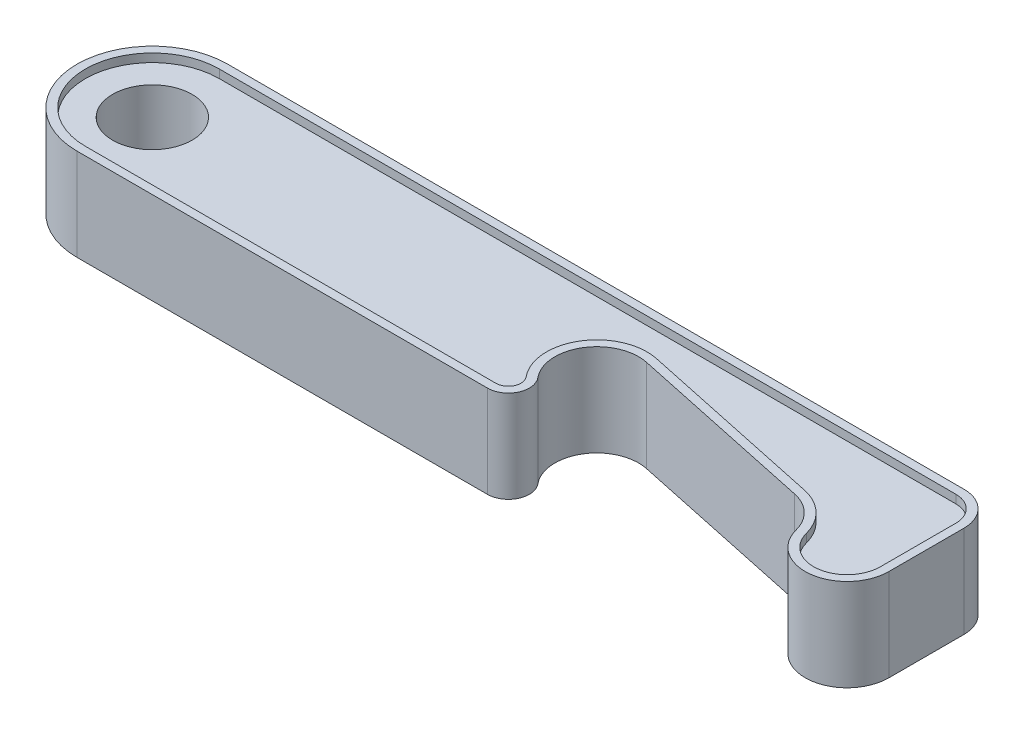
ISO-10303-21;
HEADER;
FILE_DESCRIPTION(('STEP AP214'),'2;1');
FILE_NAME('part.step','',(''),(''),'','','');
FILE_SCHEMA(('AUTOMOTIVE_DESIGN { 1 0 10303 214 1 1 1 1 }'));
ENDSEC;
DATA;
#1=APPLICATION_CONTEXT('core data for automotive mechanical design processes');
#2=APPLICATION_PROTOCOL_DEFINITION('international standard','automotive_design',2000,#1);
#3=PRODUCT_CONTEXT('',#1,'mechanical');
#4=PRODUCT('Part','Part','',(#3));
#5=PRODUCT_RELATED_PRODUCT_CATEGORY('part','',(#4));
#6=PRODUCT_DEFINITION_FORMATION('','',#4);
#7=PRODUCT_DEFINITION_CONTEXT('part definition',#1,'design');
#8=PRODUCT_DEFINITION('design','',#6,#7);
#9=PRODUCT_DEFINITION_SHAPE('','',#8);
#10=(LENGTH_UNIT() NAMED_UNIT(*) SI_UNIT(.MILLI.,.METRE.));
#11=(NAMED_UNIT(*) PLANE_ANGLE_UNIT() SI_UNIT($,.RADIAN.));
#12=(NAMED_UNIT(*) SI_UNIT($,.STERADIAN.) SOLID_ANGLE_UNIT());
#13=UNCERTAINTY_MEASURE_WITH_UNIT(LENGTH_MEASURE(1.E-05),#10,'distance_accuracy_value','');
#14=(GEOMETRIC_REPRESENTATION_CONTEXT(3) GLOBAL_UNCERTAINTY_ASSIGNED_CONTEXT((#13)) GLOBAL_UNIT_ASSIGNED_CONTEXT((#10,
#11,#12)) REPRESENTATION_CONTEXT('',''));
#15=CARTESIAN_POINT('',(0.,0.,0.));
#16=DIRECTION('',(0.,0.,1.));
#17=DIRECTION('',(1.,0.,0.));
#18=AXIS2_PLACEMENT_3D('',#15,#16,#17);
#19=CARTESIAN_POINT('',(0.,4.5,0.));
#20=DIRECTION('',(0.,-1.,0.));
#21=DIRECTION('',(0.,0.,-1.));
#22=AXIS2_PLACEMENT_3D('',#19,#20,#21);
#23=CYLINDRICAL_SURFACE('',#22,4.75);
#24=CARTESIAN_POINT('',(0.,4.5,0.));
#25=DIRECTION('',(0.,1.,0.));
#26=DIRECTION('',(0.,0.,1.));
#27=AXIS2_PLACEMENT_3D('',#24,#25,#26);
#28=CIRCLE('',#27,4.75);
#29=CARTESIAN_POINT('',(0.,4.5,4.75));
#30=VERTEX_POINT('',#29);
#31=EDGE_CURVE('E11',#30,#30,#28,.T.);
#32=ORIENTED_EDGE('',*,*,#31,.T.);
#33=EDGE_LOOP('',(#32));
#34=FACE_BOUND('',#33,.T.);
#35=CARTESIAN_POINT('',(0.,-4.5,0.));
#36=DIRECTION('',(0.,1.,0.));
#37=DIRECTION('',(0.,0.,1.));
#38=AXIS2_PLACEMENT_3D('',#35,#36,#37);
#39=CIRCLE('',#38,4.75);
#40=CARTESIAN_POINT('',(0.,-4.5,4.75));
#41=VERTEX_POINT('',#40);
#42=EDGE_CURVE('E44',#41,#41,#39,.T.);
#43=ORIENTED_EDGE('',*,*,#42,.F.);
#44=EDGE_LOOP('',(#43));
#45=FACE_BOUND('',#44,.T.);
#46=ADVANCED_FACE('F41',(#34,#45),#23,.F.);
#47=CARTESIAN_POINT('',(0.,4.5,0.));
#48=DIRECTION('',(0.,1.,0.));
#49=DIRECTION('',(0.,0.,1.));
#50=AXIS2_PLACEMENT_3D('',#47,#48,#49);
#51=PLANE('',#50);
#52=CARTESIAN_POINT('',(49.0402172346336,4.5,6.5));
#53=DIRECTION('',(0.,1.,0.));
#54=DIRECTION('',(0.,0.,1.));
#55=AXIS2_PLACEMENT_3D('',#52,#53,#54);
#56=CIRCLE('',#55,1.5);
#57=CARTESIAN_POINT('',(50.1956821146032,4.5,5.5434954724849));
#58=VERTEX_POINT('',#57);
#59=CARTESIAN_POINT('',(49.0402172346336,4.5,8.));
#60=VERTEX_POINT('',#59);
#61=EDGE_CURVE('E478',#58,#60,#56,.F.);
#62=ORIENTED_EDGE('',*,*,#61,.F.);
#63=CARTESIAN_POINT('',(54.8175416344815,4.5,1.71747736242449));
#64=DIRECTION('',(0.,1.,0.));
#65=DIRECTION('',(0.,0.,1.));
#66=AXIS2_PLACEMENT_3D('',#63,#64,#65);
#67=CIRCLE('',#66,6.);
#68=CARTESIAN_POINT('',(56.065011779388,4.5,-4.15140824197834));
#69=VERTEX_POINT('',#68);
#70=EDGE_CURVE('E481',#69,#58,#67,.T.);
#71=ORIENTED_EDGE('',*,*,#70,.F.);
#72=DIRECTION('',(-0.978147600733806,0.,-0.20791169081776));
#73=VECTOR('',#72,1.);
#74=CARTESIAN_POINT('',(3.26780239401434,4.5,-15.3738015347056));
#75=LINE('',#74,#73);
#76=CARTESIAN_POINT('',(78.565011779388,4.5,0.631114395597168));
#77=VERTEX_POINT('',#76);
#78=EDGE_CURVE('E485',#77,#69,#75,.T.);
#79=ORIENTED_EDGE('',*,*,#78,.F.);
#80=CARTESIAN_POINT('',(77.3175416344815,4.5,6.5));
#81=DIRECTION('',(0.,1.,0.));
#82=DIRECTION('',(0.,0.,1.));
#83=AXIS2_PLACEMENT_3D('',#80,#81,#82);
#84=CIRCLE('',#83,5.99999999999999);
#85=CARTESIAN_POINT('',(83.1270166537926,4.5,5.));
#86=VERTEX_POINT('',#85);
#87=EDGE_CURVE('E489',#86,#77,#84,.T.);
#88=ORIENTED_EDGE('',*,*,#87,.F.);
#89=CARTESIAN_POINT('',(87.,4.5,4.));
#90=DIRECTION('',(0.,1.,0.));
#91=DIRECTION('',(0.,0.,1.));
#92=AXIS2_PLACEMENT_3D('',#89,#90,#91);
#93=CIRCLE('',#92,4.);
#94=CARTESIAN_POINT('',(91.,4.5,4.));
#95=VERTEX_POINT('',#94);
#96=EDGE_CURVE('E493',#95,#86,#93,.F.);
#97=ORIENTED_EDGE('',*,*,#96,.F.);
#98=DIRECTION('',(0.,0.,1.));
#99=VECTOR('',#98,1.);
#100=CARTESIAN_POINT('',(91.,4.5,1.40319854501235E-13));
#101=LINE('',#100,#99);
#102=CARTESIAN_POINT('',(91.,4.5,-5.));
#103=VERTEX_POINT('',#102);
#104=EDGE_CURVE('E497',#103,#95,#101,.T.);
#105=ORIENTED_EDGE('',*,*,#104,.F.);
#106=CARTESIAN_POINT('',(88.,4.5,-5.));
#107=DIRECTION('',(0.,1.,0.));
#108=DIRECTION('',(0.,0.,1.));
#109=AXIS2_PLACEMENT_3D('',#106,#107,#108);
#110=CIRCLE('',#109,3.);
#111=CARTESIAN_POINT('',(88.,4.5,-8.));
#112=VERTEX_POINT('',#111);
#113=EDGE_CURVE('E501',#112,#103,#110,.F.);
#114=ORIENTED_EDGE('',*,*,#113,.F.);
#115=DIRECTION('',(1.,0.,0.));
#116=VECTOR('',#115,1.);
#117=CARTESIAN_POINT('',(0.,4.5,-8.));
#118=LINE('',#117,#116);
#119=CARTESIAN_POINT('',(0.,4.5,-8.));
#120=VERTEX_POINT('',#119);
#121=EDGE_CURVE('E505',#120,#112,#118,.T.);
#122=ORIENTED_EDGE('',*,*,#121,.F.);
#123=CARTESIAN_POINT('',(0.,4.5,0.));
#124=DIRECTION('',(0.,1.,0.));
#125=DIRECTION('',(0.,0.,1.));
#126=AXIS2_PLACEMENT_3D('',#123,#124,#125);
#127=CIRCLE('',#126,8.);
#128=CARTESIAN_POINT('',(0.,4.5,8.));
#129=VERTEX_POINT('',#128);
#130=EDGE_CURVE('E509',#129,#120,#127,.F.);
#131=ORIENTED_EDGE('',*,*,#130,.F.);
#132=DIRECTION('',(-1.,0.,0.));
#133=VECTOR('',#132,1.);
#134=CARTESIAN_POINT('',(0.,4.5,8.));
#135=LINE('',#134,#133);
#136=EDGE_CURVE('E51',#60,#129,#135,.T.);
#137=ORIENTED_EDGE('',*,*,#136,.F.);
#138=EDGE_LOOP('',(#62,#71,#79,#88,#97,#105,#114,#122,#131,#137));
#139=FACE_BOUND('',#138,.T.);
#140=ORIENTED_EDGE('',*,*,#31,.F.);
#141=EDGE_LOOP('',(#140));
#142=FACE_BOUND('',#141,.T.);
#143=ADVANCED_FACE('F560',(#139,#142),#51,.T.);
#144=CARTESIAN_POINT('',(0.,-4.5,0.));
#145=DIRECTION('',(0.,1.,0.));
#146=DIRECTION('',(0.,0.,1.));
#147=AXIS2_PLACEMENT_3D('',#144,#145,#146);
#148=PLANE('',#147);
#149=CARTESIAN_POINT('',(49.0402172346336,-4.5,6.5));
#150=DIRECTION('',(0.,1.,0.));
#151=DIRECTION('',(0.,0.,1.));
#152=AXIS2_PLACEMENT_3D('',#149,#150,#151);
#153=CIRCLE('',#152,1.5);
#154=CARTESIAN_POINT('',(50.1956821146032,-4.5,5.5434954724849));
#155=VERTEX_POINT('',#154);
#156=CARTESIAN_POINT('',(49.0402172346336,-4.5,8.));
#157=VERTEX_POINT('',#156);
#158=EDGE_CURVE('E452',#155,#157,#153,.F.);
#159=ORIENTED_EDGE('',*,*,#158,.T.);
#160=DIRECTION('',(-1.,0.,0.));
#161=VECTOR('',#160,1.);
#162=CARTESIAN_POINT('',(0.,-4.5,8.));
#163=LINE('',#162,#161);
#164=CARTESIAN_POINT('',(0.,-4.5,8.));
#165=VERTEX_POINT('',#164);
#166=EDGE_CURVE('E549',#157,#165,#163,.T.);
#167=ORIENTED_EDGE('',*,*,#166,.T.);
#168=CARTESIAN_POINT('',(0.,-4.5,0.));
#169=DIRECTION('',(0.,1.,0.));
#170=DIRECTION('',(0.,0.,1.));
#171=AXIS2_PLACEMENT_3D('',#168,#169,#170);
#172=CIRCLE('',#171,8.);
#173=CARTESIAN_POINT('',(0.,-4.5,-8.));
#174=VERTEX_POINT('',#173);
#175=EDGE_CURVE('E546',#165,#174,#172,.F.);
#176=ORIENTED_EDGE('',*,*,#175,.T.);
#177=DIRECTION('',(1.,0.,0.));
#178=VECTOR('',#177,1.);
#179=CARTESIAN_POINT('',(0.,-4.5,-8.));
#180=LINE('',#179,#178);
#181=CARTESIAN_POINT('',(88.,-4.5,-8.));
#182=VERTEX_POINT('',#181);
#183=EDGE_CURVE('E542',#174,#182,#180,.T.);
#184=ORIENTED_EDGE('',*,*,#183,.T.);
#185=CARTESIAN_POINT('',(88.,-4.5,-5.));
#186=DIRECTION('',(0.,1.,0.));
#187=DIRECTION('',(0.,0.,1.));
#188=AXIS2_PLACEMENT_3D('',#185,#186,#187);
#189=CIRCLE('',#188,3.);
#190=CARTESIAN_POINT('',(91.,-4.5,-5.));
#191=VERTEX_POINT('',#190);
#192=EDGE_CURVE('E538',#182,#191,#189,.F.);
#193=ORIENTED_EDGE('',*,*,#192,.T.);
#194=DIRECTION('',(0.,0.,1.));
#195=VECTOR('',#194,1.);
#196=CARTESIAN_POINT('',(91.,-4.5,1.40319854501235E-13));
#197=LINE('',#196,#195);
#198=CARTESIAN_POINT('',(91.,-4.5,4.));
#199=VERTEX_POINT('',#198);
#200=EDGE_CURVE('E534',#191,#199,#197,.T.);
#201=ORIENTED_EDGE('',*,*,#200,.T.);
#202=CARTESIAN_POINT('',(87.,-4.5,4.));
#203=DIRECTION('',(0.,1.,0.));
#204=DIRECTION('',(0.,0.,1.));
#205=AXIS2_PLACEMENT_3D('',#202,#203,#204);
#206=CIRCLE('',#205,4.);
#207=CARTESIAN_POINT('',(83.1270166537926,-4.5,5.));
#208=VERTEX_POINT('',#207);
#209=EDGE_CURVE('E530',#199,#208,#206,.F.);
#210=ORIENTED_EDGE('',*,*,#209,.T.);
#211=CARTESIAN_POINT('',(77.3175416344815,-4.5,6.5));
#212=DIRECTION('',(0.,1.,0.));
#213=DIRECTION('',(0.,0.,1.));
#214=AXIS2_PLACEMENT_3D('',#211,#212,#213);
#215=CIRCLE('',#214,5.99999999999999);
#216=CARTESIAN_POINT('',(78.565011779388,-4.5,0.631114395597168));
#217=VERTEX_POINT('',#216);
#218=EDGE_CURVE('E526',#208,#217,#215,.T.);
#219=ORIENTED_EDGE('',*,*,#218,.T.);
#220=DIRECTION('',(-0.978147600733806,0.,-0.20791169081776));
#221=VECTOR('',#220,1.);
#222=CARTESIAN_POINT('',(3.26780239401434,-4.5,-15.3738015347056));
#223=LINE('',#222,#221);
#224=CARTESIAN_POINT('',(56.065011779388,-4.5,-4.15140824197834));
#225=VERTEX_POINT('',#224);
#226=EDGE_CURVE('E522',#217,#225,#223,.T.);
#227=ORIENTED_EDGE('',*,*,#226,.T.);
#228=CARTESIAN_POINT('',(54.8175416344815,-4.5,1.71747736242449));
#229=DIRECTION('',(0.,1.,0.));
#230=DIRECTION('',(0.,0.,1.));
#231=AXIS2_PLACEMENT_3D('',#228,#229,#230);
#232=CIRCLE('',#231,6.);
#233=EDGE_CURVE('E518',#225,#155,#232,.T.);
#234=ORIENTED_EDGE('',*,*,#233,.T.);
#235=EDGE_LOOP('',(#159,#167,#176,#184,#193,#201,#210,#219,#227,#234));
#236=FACE_BOUND('',#235,.T.);
#237=ORIENTED_EDGE('',*,*,#42,.T.);
#238=EDGE_LOOP('',(#237));
#239=FACE_BOUND('',#238,.T.);
#240=ADVANCED_FACE('F557',(#236,#239),#148,.F.);
#241=CARTESIAN_POINT('',(54.8175416344815,5.5,1.71747736242449));
#242=DIRECTION('',(0.,-1.,0.));
#243=DIRECTION('',(0.,0.,-1.));
#244=AXIS2_PLACEMENT_3D('',#241,#242,#243);
#245=CYLINDRICAL_SURFACE('',#244,6.);
#246=DIRECTION('',(0.,-1.,0.));
#247=VECTOR('',#246,1.);
#248=CARTESIAN_POINT('',(50.1956821146032,5.5,5.5434954724849));
#249=LINE('',#248,#247);
#250=CARTESIAN_POINT('',(50.1956821146032,-5.5,5.5434954724849));
#251=VERTEX_POINT('',#250);
#252=EDGE_CURVE('E447',#155,#251,#249,.T.);
#253=ORIENTED_EDGE('',*,*,#252,.F.);
#254=ORIENTED_EDGE('',*,*,#233,.F.);
#255=DIRECTION('',(0.,-1.,0.));
#256=VECTOR('',#255,1.);
#257=CARTESIAN_POINT('',(56.065011779388,5.5,-4.15140824197834));
#258=LINE('',#257,#256);
#259=CARTESIAN_POINT('',(56.065011779388,-5.5,-4.15140824197834));
#260=VERTEX_POINT('',#259);
#261=EDGE_CURVE('E246',#225,#260,#258,.T.);
#262=ORIENTED_EDGE('',*,*,#261,.T.);
#263=CARTESIAN_POINT('',(54.8175416344815,-5.5,1.71747736242449));
#264=DIRECTION('',(0.,1.,0.));
#265=DIRECTION('',(0.,0.,1.));
#266=AXIS2_PLACEMENT_3D('',#263,#264,#265);
#267=CIRCLE('',#266,6.);
#268=EDGE_CURVE('E364',#260,#251,#267,.T.);
#269=ORIENTED_EDGE('',*,*,#268,.T.);
#270=EDGE_LOOP('',(#253,#254,#262,#269));
#271=FACE_BOUND('',#270,.T.);
#272=ADVANCED_FACE('F571',(#271),#245,.T.);
#273=CARTESIAN_POINT('',(49.0402172346336,5.5,6.5));
#274=DIRECTION('',(0.,-1.,0.));
#275=DIRECTION('',(0.,0.,-1.));
#276=AXIS2_PLACEMENT_3D('',#273,#274,#275);
#277=CYLINDRICAL_SURFACE('',#276,1.5);
#278=DIRECTION('',(0.,-1.,0.));
#279=VECTOR('',#278,1.);
#280=CARTESIAN_POINT('',(49.0402172346336,5.5,8.));
#281=LINE('',#280,#279);
#282=CARTESIAN_POINT('',(49.0402172346336,-5.5,8.));
#283=VERTEX_POINT('',#282);
#284=EDGE_CURVE('E442',#157,#283,#281,.T.);
#285=ORIENTED_EDGE('',*,*,#284,.F.);
#286=ORIENTED_EDGE('',*,*,#158,.F.);
#287=ORIENTED_EDGE('',*,*,#252,.T.);
#288=CARTESIAN_POINT('',(49.0402172346336,-5.5,6.5));
#289=DIRECTION('',(0.,1.,0.));
#290=DIRECTION('',(0.,0.,1.));
#291=AXIS2_PLACEMENT_3D('',#288,#289,#290);
#292=CIRCLE('',#291,1.5);
#293=EDGE_CURVE('E368',#251,#283,#292,.F.);
#294=ORIENTED_EDGE('',*,*,#293,.T.);
#295=EDGE_LOOP('',(#285,#286,#287,#294));
#296=FACE_BOUND('',#295,.T.);
#297=ADVANCED_FACE('F621',(#296),#277,.F.);
#298=CARTESIAN_POINT('',(0.,5.5,8.));
#299=DIRECTION('',(0.,0.,1.));
#300=DIRECTION('',(1.,0.,0.));
#301=AXIS2_PLACEMENT_3D('',#298,#299,#300);
#302=PLANE('',#301);
#303=DIRECTION('',(0.,-1.,0.));
#304=VECTOR('',#303,1.);
#305=CARTESIAN_POINT('',(0.,5.5,8.));
#306=LINE('',#305,#304);
#307=CARTESIAN_POINT('',(0.,-5.5,8.));
#308=VERTEX_POINT('',#307);
#309=EDGE_CURVE('E437',#165,#308,#306,.T.);
#310=ORIENTED_EDGE('',*,*,#309,.F.);
#311=ORIENTED_EDGE('',*,*,#166,.F.);
#312=ORIENTED_EDGE('',*,*,#284,.T.);
#313=DIRECTION('',(-1.,0.,0.));
#314=VECTOR('',#313,1.);
#315=CARTESIAN_POINT('',(0.,-5.5,8.));
#316=LINE('',#315,#314);
#317=EDGE_CURVE('E372',#283,#308,#316,.T.);
#318=ORIENTED_EDGE('',*,*,#317,.T.);
#319=EDGE_LOOP('',(#310,#311,#312,#318));
#320=FACE_BOUND('',#319,.T.);
#321=ADVANCED_FACE('F626',(#320),#302,.F.);
#322=CARTESIAN_POINT('',(0.,5.5,0.));
#323=DIRECTION('',(0.,-1.,0.));
#324=DIRECTION('',(0.,0.,-1.));
#325=AXIS2_PLACEMENT_3D('',#322,#323,#324);
#326=CYLINDRICAL_SURFACE('',#325,8.);
#327=DIRECTION('',(0.,-1.,0.));
#328=VECTOR('',#327,1.);
#329=CARTESIAN_POINT('',(0.,5.5,-8.));
#330=LINE('',#329,#328);
#331=CARTESIAN_POINT('',(0.,-5.5,-8.));
#332=VERTEX_POINT('',#331);
#333=EDGE_CURVE('E432',#174,#332,#330,.T.);
#334=ORIENTED_EDGE('',*,*,#333,.F.);
#335=ORIENTED_EDGE('',*,*,#175,.F.);
#336=ORIENTED_EDGE('',*,*,#309,.T.);
#337=CARTESIAN_POINT('',(0.,-5.5,0.));
#338=DIRECTION('',(0.,1.,0.));
#339=DIRECTION('',(0.,0.,1.));
#340=AXIS2_PLACEMENT_3D('',#337,#338,#339);
#341=CIRCLE('',#340,8.);
#342=EDGE_CURVE('E376',#308,#332,#341,.F.);
#343=ORIENTED_EDGE('',*,*,#342,.T.);
#344=EDGE_LOOP('',(#334,#335,#336,#343));
#345=FACE_BOUND('',#344,.T.);
#346=ADVANCED_FACE('F631',(#345),#326,.F.);
#347=CARTESIAN_POINT('',(0.,5.5,-8.));
#348=DIRECTION('',(0.,0.,-1.));
#349=DIRECTION('',(-1.,0.,0.));
#350=AXIS2_PLACEMENT_3D('',#347,#348,#349);
#351=PLANE('',#350);
#352=DIRECTION('',(0.,-1.,0.));
#353=VECTOR('',#352,1.);
#354=CARTESIAN_POINT('',(88.,5.5,-8.));
#355=LINE('',#354,#353);
#356=CARTESIAN_POINT('',(88.,-5.5,-8.));
#357=VERTEX_POINT('',#356);
#358=EDGE_CURVE('E427',#182,#357,#355,.T.);
#359=ORIENTED_EDGE('',*,*,#358,.F.);
#360=ORIENTED_EDGE('',*,*,#183,.F.);
#361=ORIENTED_EDGE('',*,*,#333,.T.);
#362=DIRECTION('',(1.,0.,0.));
#363=VECTOR('',#362,1.);
#364=CARTESIAN_POINT('',(0.,-5.5,-8.));
#365=LINE('',#364,#363);
#366=EDGE_CURVE('E380',#332,#357,#365,.T.);
#367=ORIENTED_EDGE('',*,*,#366,.T.);
#368=EDGE_LOOP('',(#359,#360,#361,#367));
#369=FACE_BOUND('',#368,.T.);
#370=ADVANCED_FACE('F636',(#369),#351,.F.);
#371=CARTESIAN_POINT('',(88.,5.5,-5.));
#372=DIRECTION('',(0.,-1.,0.));
#373=DIRECTION('',(0.,0.,-1.));
#374=AXIS2_PLACEMENT_3D('',#371,#372,#373);
#375=CYLINDRICAL_SURFACE('',#374,3.);
#376=DIRECTION('',(0.,-1.,0.));
#377=VECTOR('',#376,1.);
#378=CARTESIAN_POINT('',(91.,5.5,-5.));
#379=LINE('',#378,#377);
#380=CARTESIAN_POINT('',(91.,-5.5,-5.));
#381=VERTEX_POINT('',#380);
#382=EDGE_CURVE('E422',#191,#381,#379,.T.);
#383=ORIENTED_EDGE('',*,*,#382,.F.);
#384=ORIENTED_EDGE('',*,*,#192,.F.);
#385=ORIENTED_EDGE('',*,*,#358,.T.);
#386=CARTESIAN_POINT('',(88.,-5.5,-5.));
#387=DIRECTION('',(0.,1.,0.));
#388=DIRECTION('',(0.,0.,1.));
#389=AXIS2_PLACEMENT_3D('',#386,#387,#388);
#390=CIRCLE('',#389,3.);
#391=EDGE_CURVE('E384',#357,#381,#390,.F.);
#392=ORIENTED_EDGE('',*,*,#391,.T.);
#393=EDGE_LOOP('',(#383,#384,#385,#392));
#394=FACE_BOUND('',#393,.T.);
#395=ADVANCED_FACE('F641',(#394),#375,.F.);
#396=CARTESIAN_POINT('',(91.,5.5,1.40319854501235E-13));
#397=DIRECTION('',(1.,0.,0.));
#398=DIRECTION('',(0.,0.,-1.));
#399=AXIS2_PLACEMENT_3D('',#396,#397,#398);
#400=PLANE('',#399);
#401=DIRECTION('',(0.,-1.,0.));
#402=VECTOR('',#401,1.);
#403=CARTESIAN_POINT('',(91.,5.5,4.));
#404=LINE('',#403,#402);
#405=CARTESIAN_POINT('',(91.,-5.5,4.));
#406=VERTEX_POINT('',#405);
#407=EDGE_CURVE('E417',#199,#406,#404,.T.);
#408=ORIENTED_EDGE('',*,*,#407,.F.);
#409=ORIENTED_EDGE('',*,*,#200,.F.);
#410=ORIENTED_EDGE('',*,*,#382,.T.);
#411=DIRECTION('',(0.,0.,1.));
#412=VECTOR('',#411,1.);
#413=CARTESIAN_POINT('',(91.,-5.5,1.40319854501235E-13));
#414=LINE('',#413,#412);
#415=EDGE_CURVE('E388',#381,#406,#414,.T.);
#416=ORIENTED_EDGE('',*,*,#415,.T.);
#417=EDGE_LOOP('',(#408,#409,#410,#416));
#418=FACE_BOUND('',#417,.T.);
#419=ADVANCED_FACE('F646',(#418),#400,.F.);
#420=CARTESIAN_POINT('',(87.,5.5,4.));
#421=DIRECTION('',(0.,-1.,0.));
#422=DIRECTION('',(0.,0.,-1.));
#423=AXIS2_PLACEMENT_3D('',#420,#421,#422);
#424=CYLINDRICAL_SURFACE('',#423,4.);
#425=DIRECTION('',(0.,-1.,0.));
#426=VECTOR('',#425,1.);
#427=CARTESIAN_POINT('',(83.1270166537926,5.5,5.));
#428=LINE('',#427,#426);
#429=CARTESIAN_POINT('',(83.1270166537926,-5.5,5.));
#430=VERTEX_POINT('',#429);
#431=EDGE_CURVE('E412',#208,#430,#428,.T.);
#432=ORIENTED_EDGE('',*,*,#431,.F.);
#433=ORIENTED_EDGE('',*,*,#209,.F.);
#434=ORIENTED_EDGE('',*,*,#407,.T.);
#435=CARTESIAN_POINT('',(87.,-5.5,4.));
#436=DIRECTION('',(0.,1.,0.));
#437=DIRECTION('',(0.,0.,1.));
#438=AXIS2_PLACEMENT_3D('',#435,#436,#437);
#439=CIRCLE('',#438,4.);
#440=EDGE_CURVE('E392',#406,#430,#439,.F.);
#441=ORIENTED_EDGE('',*,*,#440,.T.);
#442=EDGE_LOOP('',(#432,#433,#434,#441));
#443=FACE_BOUND('',#442,.T.);
#444=ADVANCED_FACE('F650',(#443),#424,.F.);
#445=CARTESIAN_POINT('',(77.3175416344815,5.5,6.5));
#446=DIRECTION('',(0.,-1.,0.));
#447=DIRECTION('',(0.,0.,-1.));
#448=AXIS2_PLACEMENT_3D('',#445,#446,#447);
#449=CYLINDRICAL_SURFACE('',#448,5.99999999999999);
#450=DIRECTION('',(0.,-1.,0.));
#451=VECTOR('',#450,1.);
#452=CARTESIAN_POINT('',(78.565011779388,5.5,0.631114395597168));
#453=LINE('',#452,#451);
#454=CARTESIAN_POINT('',(78.565011779388,-5.5,0.631114395597168));
#455=VERTEX_POINT('',#454);
#456=EDGE_CURVE('E407',#217,#455,#453,.T.);
#457=ORIENTED_EDGE('',*,*,#456,.F.);
#458=ORIENTED_EDGE('',*,*,#218,.F.);
#459=ORIENTED_EDGE('',*,*,#431,.T.);
#460=CARTESIAN_POINT('',(77.3175416344815,-5.5,6.5));
#461=DIRECTION('',(0.,1.,0.));
#462=DIRECTION('',(0.,0.,1.));
#463=AXIS2_PLACEMENT_3D('',#460,#461,#462);
#464=CIRCLE('',#463,5.99999999999999);
#465=EDGE_CURVE('E396',#430,#455,#464,.T.);
#466=ORIENTED_EDGE('',*,*,#465,.T.);
#467=EDGE_LOOP('',(#457,#458,#459,#466));
#468=FACE_BOUND('',#467,.T.);
#469=ADVANCED_FACE('F654',(#468),#449,.T.);
#470=CARTESIAN_POINT('',(3.26780239401434,5.5,-15.3738015347056));
#471=DIRECTION('',(-0.20791169081776,0.,0.978147600733806));
#472=DIRECTION('',(0.978147600733806,0.,0.20791169081776));
#473=AXIS2_PLACEMENT_3D('',#470,#471,#472);
#474=PLANE('',#473);
#475=ORIENTED_EDGE('',*,*,#261,.F.);
#476=ORIENTED_EDGE('',*,*,#226,.F.);
#477=ORIENTED_EDGE('',*,*,#456,.T.);
#478=DIRECTION('',(-0.978147600733806,0.,-0.20791169081776));
#479=VECTOR('',#478,1.);
#480=CARTESIAN_POINT('',(3.26780239401434,-5.5,-15.3738015347056));
#481=LINE('',#480,#479);
#482=EDGE_CURVE('E260',#455,#260,#481,.T.);
#483=ORIENTED_EDGE('',*,*,#482,.T.);
#484=EDGE_LOOP('',(#475,#476,#477,#483));
#485=FACE_BOUND('',#484,.T.);
#486=ADVANCED_FACE('F615',(#485),#474,.F.);
#487=ORIENTED_EDGE('',*,*,#70,.T.);
#488=CARTESIAN_POINT('',(50.1956821146032,5.5,5.5434954724849));
#489=VERTEX_POINT('',#488);
#490=EDGE_CURVE('E448',#489,#58,#249,.T.);
#491=ORIENTED_EDGE('',*,*,#490,.F.);
#492=CARTESIAN_POINT('',(54.8175416344815,5.5,1.71747736242449));
#493=DIRECTION('',(0.,1.,0.));
#494=DIRECTION('',(0.,0.,1.));
#495=AXIS2_PLACEMENT_3D('',#492,#493,#494);
#496=CIRCLE('',#495,6.);
#497=CARTESIAN_POINT('',(56.065011779388,5.5,-4.15140824197834));
#498=VERTEX_POINT('',#497);
#499=EDGE_CURVE('E295',#498,#489,#496,.T.);
#500=ORIENTED_EDGE('',*,*,#499,.F.);
#501=EDGE_CURVE('E403',#498,#69,#258,.T.);
#502=ORIENTED_EDGE('',*,*,#501,.T.);
#503=EDGE_LOOP('',(#487,#491,#500,#502));
#504=FACE_BOUND('',#503,.T.);
#505=ADVANCED_FACE('F611',(#504),#245,.T.);
#506=ORIENTED_EDGE('',*,*,#61,.T.);
#507=CARTESIAN_POINT('',(49.0402172346336,5.5,8.));
#508=VERTEX_POINT('',#507);
#509=EDGE_CURVE('E443',#508,#60,#281,.T.);
#510=ORIENTED_EDGE('',*,*,#509,.F.);
#511=CARTESIAN_POINT('',(49.0402172346336,5.5,6.5));
#512=DIRECTION('',(0.,1.,0.));
#513=DIRECTION('',(0.,0.,1.));
#514=AXIS2_PLACEMENT_3D('',#511,#512,#513);
#515=CIRCLE('',#514,1.5);
#516=EDGE_CURVE('E299',#489,#508,#515,.F.);
#517=ORIENTED_EDGE('',*,*,#516,.F.);
#518=ORIENTED_EDGE('',*,*,#490,.T.);
#519=EDGE_LOOP('',(#506,#510,#517,#518));
#520=FACE_BOUND('',#519,.T.);
#521=ADVANCED_FACE('F614',(#520),#277,.F.);
#522=ORIENTED_EDGE('',*,*,#136,.T.);
#523=CARTESIAN_POINT('',(0.,5.5,8.));
#524=VERTEX_POINT('',#523);
#525=EDGE_CURVE('E438',#524,#129,#306,.T.);
#526=ORIENTED_EDGE('',*,*,#525,.F.);
#527=DIRECTION('',(-1.,0.,0.));
#528=VECTOR('',#527,1.);
#529=CARTESIAN_POINT('',(0.,5.5,8.));
#530=LINE('',#529,#528);
#531=EDGE_CURVE('E302',#508,#524,#530,.T.);
#532=ORIENTED_EDGE('',*,*,#531,.F.);
#533=ORIENTED_EDGE('',*,*,#509,.T.);
#534=EDGE_LOOP('',(#522,#526,#532,#533));
#535=FACE_BOUND('',#534,.T.);
#536=ADVANCED_FACE('F619',(#535),#302,.F.);
#537=ORIENTED_EDGE('',*,*,#130,.T.);
#538=CARTESIAN_POINT('',(0.,5.5,-8.));
#539=VERTEX_POINT('',#538);
#540=EDGE_CURVE('E433',#539,#120,#330,.T.);
#541=ORIENTED_EDGE('',*,*,#540,.F.);
#542=CARTESIAN_POINT('',(0.,5.5,0.));
#543=DIRECTION('',(0.,1.,0.));
#544=DIRECTION('',(0.,0.,1.));
#545=AXIS2_PLACEMENT_3D('',#542,#543,#544);
#546=CIRCLE('',#545,8.);
#547=EDGE_CURVE('E305',#524,#539,#546,.F.);
#548=ORIENTED_EDGE('',*,*,#547,.F.);
#549=ORIENTED_EDGE('',*,*,#525,.T.);
#550=EDGE_LOOP('',(#537,#541,#548,#549));
#551=FACE_BOUND('',#550,.T.);
#552=ADVANCED_FACE('F624',(#551),#326,.F.);
#553=ORIENTED_EDGE('',*,*,#121,.T.);
#554=CARTESIAN_POINT('',(88.,5.5,-8.));
#555=VERTEX_POINT('',#554);
#556=EDGE_CURVE('E428',#555,#112,#355,.T.);
#557=ORIENTED_EDGE('',*,*,#556,.F.);
#558=DIRECTION('',(1.,0.,0.));
#559=VECTOR('',#558,1.);
#560=CARTESIAN_POINT('',(0.,5.5,-8.));
#561=LINE('',#560,#559);
#562=EDGE_CURVE('E308',#539,#555,#561,.T.);
#563=ORIENTED_EDGE('',*,*,#562,.F.);
#564=ORIENTED_EDGE('',*,*,#540,.T.);
#565=EDGE_LOOP('',(#553,#557,#563,#564));
#566=FACE_BOUND('',#565,.T.);
#567=ADVANCED_FACE('F629',(#566),#351,.F.);
#568=ORIENTED_EDGE('',*,*,#113,.T.);
#569=CARTESIAN_POINT('',(91.,5.5,-5.));
#570=VERTEX_POINT('',#569);
#571=EDGE_CURVE('E423',#570,#103,#379,.T.);
#572=ORIENTED_EDGE('',*,*,#571,.F.);
#573=CARTESIAN_POINT('',(88.,5.5,-5.));
#574=DIRECTION('',(0.,1.,0.));
#575=DIRECTION('',(0.,0.,1.));
#576=AXIS2_PLACEMENT_3D('',#573,#574,#575);
#577=CIRCLE('',#576,3.);
#578=EDGE_CURVE('E311',#555,#570,#577,.F.);
#579=ORIENTED_EDGE('',*,*,#578,.F.);
#580=ORIENTED_EDGE('',*,*,#556,.T.);
#581=EDGE_LOOP('',(#568,#572,#579,#580));
#582=FACE_BOUND('',#581,.T.);
#583=ADVANCED_FACE('F634',(#582),#375,.F.);
#584=ORIENTED_EDGE('',*,*,#104,.T.);
#585=CARTESIAN_POINT('',(91.,5.5,4.));
#586=VERTEX_POINT('',#585);
#587=EDGE_CURVE('E418',#586,#95,#404,.T.);
#588=ORIENTED_EDGE('',*,*,#587,.F.);
#589=DIRECTION('',(0.,0.,1.));
#590=VECTOR('',#589,1.);
#591=CARTESIAN_POINT('',(91.,5.5,1.40319854501235E-13));
#592=LINE('',#591,#590);
#593=EDGE_CURVE('E314',#570,#586,#592,.T.);
#594=ORIENTED_EDGE('',*,*,#593,.F.);
#595=ORIENTED_EDGE('',*,*,#571,.T.);
#596=EDGE_LOOP('',(#584,#588,#594,#595));
#597=FACE_BOUND('',#596,.T.);
#598=ADVANCED_FACE('F639',(#597),#400,.F.);
#599=ORIENTED_EDGE('',*,*,#96,.T.);
#600=CARTESIAN_POINT('',(83.1270166537926,5.5,5.));
#601=VERTEX_POINT('',#600);
#602=EDGE_CURVE('E413',#601,#86,#428,.T.);
#603=ORIENTED_EDGE('',*,*,#602,.F.);
#604=CARTESIAN_POINT('',(87.,5.5,4.));
#605=DIRECTION('',(0.,1.,0.));
#606=DIRECTION('',(0.,0.,1.));
#607=AXIS2_PLACEMENT_3D('',#604,#605,#606);
#608=CIRCLE('',#607,4.);
#609=EDGE_CURVE('E317',#586,#601,#608,.F.);
#610=ORIENTED_EDGE('',*,*,#609,.F.);
#611=ORIENTED_EDGE('',*,*,#587,.T.);
#612=EDGE_LOOP('',(#599,#603,#610,#611));
#613=FACE_BOUND('',#612,.T.);
#614=ADVANCED_FACE('F644',(#613),#424,.F.);
#615=ORIENTED_EDGE('',*,*,#87,.T.);
#616=CARTESIAN_POINT('',(78.565011779388,5.5,0.631114395597168));
#617=VERTEX_POINT('',#616);
#618=EDGE_CURVE('E408',#617,#77,#453,.T.);
#619=ORIENTED_EDGE('',*,*,#618,.F.);
#620=CARTESIAN_POINT('',(77.3175416344815,5.5,6.5));
#621=DIRECTION('',(0.,1.,0.));
#622=DIRECTION('',(0.,0.,1.));
#623=AXIS2_PLACEMENT_3D('',#620,#621,#622);
#624=CIRCLE('',#623,5.99999999999999);
#625=EDGE_CURVE('E320',#601,#617,#624,.T.);
#626=ORIENTED_EDGE('',*,*,#625,.F.);
#627=ORIENTED_EDGE('',*,*,#602,.T.);
#628=EDGE_LOOP('',(#615,#619,#626,#627));
#629=FACE_BOUND('',#628,.T.);
#630=ADVANCED_FACE('F575',(#629),#449,.T.);
#631=CARTESIAN_POINT('',(0.,5.5,0.));
#632=DIRECTION('',(0.,-1.,0.));
#633=DIRECTION('',(0.,0.,-1.));
#634=AXIS2_PLACEMENT_3D('',#631,#632,#633);
#635=CYLINDRICAL_SURFACE('',#634,9.);
#636=CARTESIAN_POINT('',(0.,-5.5,0.));
#637=DIRECTION('',(0.,1.,0.));
#638=DIRECTION('',(0.,0.,1.));
#639=AXIS2_PLACEMENT_3D('',#636,#637,#638);
#640=CIRCLE('',#639,9.);
#641=CARTESIAN_POINT('',(0.,-5.5,9.));
#642=VERTEX_POINT('',#641);
#643=CARTESIAN_POINT('',(0.,-5.5,-9.));
#644=VERTEX_POINT('',#643);
#645=EDGE_CURVE('E240',#642,#644,#640,.F.);
#646=ORIENTED_EDGE('',*,*,#645,.F.);
#647=DIRECTION('',(0.,-1.,0.));
#648=VECTOR('',#647,1.);
#649=CARTESIAN_POINT('',(0.,5.5,9.));
#650=LINE('',#649,#648);
#651=CARTESIAN_POINT('',(0.,5.5,9.));
#652=VERTEX_POINT('',#651);
#653=EDGE_CURVE('E234',#652,#642,#650,.T.);
#654=ORIENTED_EDGE('',*,*,#653,.F.);
#655=CARTESIAN_POINT('',(0.,5.5,0.));
#656=DIRECTION('',(0.,1.,0.));
#657=DIRECTION('',(0.,0.,1.));
#658=AXIS2_PLACEMENT_3D('',#655,#656,#657);
#659=CIRCLE('',#658,9.);
#660=CARTESIAN_POINT('',(0.,5.5,-9.));
#661=VERTEX_POINT('',#660);
#662=EDGE_CURVE('E237',#652,#661,#659,.F.);
#663=ORIENTED_EDGE('',*,*,#662,.T.);
#664=DIRECTION('',(0.,-1.,0.));
#665=VECTOR('',#664,1.);
#666=CARTESIAN_POINT('',(0.,5.5,-9.));
#667=LINE('',#666,#665);
#668=EDGE_CURVE('E326',#661,#644,#667,.T.);
#669=ORIENTED_EDGE('',*,*,#668,.T.);
#670=EDGE_LOOP('',(#646,#654,#663,#669));
#671=FACE_BOUND('',#670,.T.);
#672=ADVANCED_FACE('F236',(#671),#635,.T.);
#673=CARTESIAN_POINT('',(0.,5.5,9.));
#674=DIRECTION('',(0.,0.,1.));
#675=DIRECTION('',(1.,0.,0.));
#676=AXIS2_PLACEMENT_3D('',#673,#674,#675);
#677=PLANE('',#676);
#678=DIRECTION('',(-1.,0.,0.));
#679=VECTOR('',#678,1.);
#680=CARTESIAN_POINT('',(0.,-5.5,9.));
#681=LINE('',#680,#679);
#682=CARTESIAN_POINT('',(49.0402172346336,-5.5,9.));
#683=VERTEX_POINT('',#682);
#684=EDGE_CURVE('E329',#683,#642,#681,.T.);
#685=ORIENTED_EDGE('',*,*,#684,.F.);
#686=DIRECTION('',(0.,-1.,0.));
#687=VECTOR('',#686,1.);
#688=CARTESIAN_POINT('',(49.0402172346336,5.5,9.));
#689=LINE('',#688,#687);
#690=CARTESIAN_POINT('',(49.0402172346336,5.5,9.));
#691=VERTEX_POINT('',#690);
#692=EDGE_CURVE('E247',#691,#683,#689,.T.);
#693=ORIENTED_EDGE('',*,*,#692,.F.);
#694=DIRECTION('',(-1.,0.,0.));
#695=VECTOR('',#694,1.);
#696=CARTESIAN_POINT('',(0.,5.5,9.));
#697=LINE('',#696,#695);
#698=EDGE_CURVE('E254',#691,#652,#697,.T.);
#699=ORIENTED_EDGE('',*,*,#698,.T.);
#700=ORIENTED_EDGE('',*,*,#653,.T.);
#701=EDGE_LOOP('',(#685,#693,#699,#700));
#702=FACE_BOUND('',#701,.T.);
#703=ADVANCED_FACE('F262',(#702),#677,.T.);
#704=CARTESIAN_POINT('',(49.0402172346336,5.5,6.5));
#705=DIRECTION('',(0.,-1.,0.));
#706=DIRECTION('',(0.,0.,-1.));
#707=AXIS2_PLACEMENT_3D('',#704,#705,#706);
#708=CYLINDRICAL_SURFACE('',#707,2.5);
#709=CARTESIAN_POINT('',(49.0402172346336,-5.5,6.5));
#710=DIRECTION('',(0.,1.,0.));
#711=DIRECTION('',(0.,0.,1.));
#712=AXIS2_PLACEMENT_3D('',#709,#710,#711);
#713=CIRCLE('',#712,2.5);
#714=CARTESIAN_POINT('',(50.9659920345829,-5.5,4.90582578747483));
#715=VERTEX_POINT('',#714);
#716=EDGE_CURVE('E332',#715,#683,#713,.F.);
#717=ORIENTED_EDGE('',*,*,#716,.F.);
#718=DIRECTION('',(0.,-1.,0.));
#719=VECTOR('',#718,1.);
#720=CARTESIAN_POINT('',(50.9659920345829,5.5,4.90582578747483));
#721=LINE('',#720,#719);
#722=CARTESIAN_POINT('',(50.9659920345829,5.5,4.90582578747483));
#723=VERTEX_POINT('',#722);
#724=EDGE_CURVE('E473',#723,#715,#721,.T.);
#725=ORIENTED_EDGE('',*,*,#724,.F.);
#726=CARTESIAN_POINT('',(49.0402172346336,5.5,6.5));
#727=DIRECTION('',(0.,1.,0.));
#728=DIRECTION('',(0.,0.,1.));
#729=AXIS2_PLACEMENT_3D('',#726,#727,#728);
#730=CIRCLE('',#729,2.5);
#731=EDGE_CURVE('E264',#723,#691,#730,.F.);
#732=ORIENTED_EDGE('',*,*,#731,.T.);
#733=ORIENTED_EDGE('',*,*,#692,.T.);
#734=EDGE_LOOP('',(#717,#725,#732,#733));
#735=FACE_BOUND('',#734,.T.);
#736=ADVANCED_FACE('F578',(#735),#708,.T.);
#737=CARTESIAN_POINT('',(54.8175416344815,5.5,1.71747736242449));
#738=DIRECTION('',(0.,-1.,0.));
#739=DIRECTION('',(0.,0.,-1.));
#740=AXIS2_PLACEMENT_3D('',#737,#738,#739);
#741=CYLINDRICAL_SURFACE('',#740,5.);
#742=CARTESIAN_POINT('',(54.8175416344815,-5.5,1.71747736242449));
#743=DIRECTION('',(0.,1.,0.));
#744=DIRECTION('',(0.,0.,1.));
#745=AXIS2_PLACEMENT_3D('',#742,#743,#744);
#746=CIRCLE('',#745,5.);
#747=CARTESIAN_POINT('',(55.8571000885703,-5.5,-3.17326064124454));
#748=VERTEX_POINT('',#747);
#749=EDGE_CURVE('E336',#748,#715,#746,.T.);
#750=ORIENTED_EDGE('',*,*,#749,.F.);
#751=DIRECTION('',(0.,-1.,0.));
#752=VECTOR('',#751,1.);
#753=CARTESIAN_POINT('',(55.8571000885703,5.5,-3.17326064124454));
#754=LINE('',#753,#752);
#755=CARTESIAN_POINT('',(55.8571000885703,5.5,-3.17326064124454));
#756=VERTEX_POINT('',#755);
#757=EDGE_CURVE('E470',#756,#748,#754,.T.);
#758=ORIENTED_EDGE('',*,*,#757,.F.);
#759=CARTESIAN_POINT('',(54.8175416344815,5.5,1.71747736242449));
#760=DIRECTION('',(0.,1.,0.));
#761=DIRECTION('',(0.,0.,1.));
#762=AXIS2_PLACEMENT_3D('',#759,#760,#761);
#763=CIRCLE('',#762,5.);
#764=EDGE_CURVE('E267',#756,#723,#763,.T.);
#765=ORIENTED_EDGE('',*,*,#764,.T.);
#766=ORIENTED_EDGE('',*,*,#724,.T.);
#767=EDGE_LOOP('',(#750,#758,#765,#766));
#768=FACE_BOUND('',#767,.T.);
#769=ADVANCED_FACE('F581',(#768),#741,.F.);
#770=CARTESIAN_POINT('',(3.05989070319659,5.5,-14.3956539339718));
#771=DIRECTION('',(-0.20791169081776,0.,0.978147600733806));
#772=DIRECTION('',(0.978147600733806,0.,0.20791169081776));
#773=AXIS2_PLACEMENT_3D('',#770,#771,#772);
#774=PLANE('',#773);
#775=DIRECTION('',(-0.978147600733805,0.,-0.20791169081776));
#776=VECTOR('',#775,1.);
#777=CARTESIAN_POINT('',(3.05989070319659,-5.5,-14.3956539339718));
#778=LINE('',#777,#776);
#779=CARTESIAN_POINT('',(78.3571000885703,-5.5,1.60926199633097));
#780=VERTEX_POINT('',#779);
#781=EDGE_CURVE('E340',#780,#748,#778,.T.);
#782=ORIENTED_EDGE('',*,*,#781,.F.);
#783=DIRECTION('',(0.,-1.,0.));
#784=VECTOR('',#783,1.);
#785=CARTESIAN_POINT('',(78.3571000885703,5.5,1.60926199633097));
#786=LINE('',#785,#784);
#787=CARTESIAN_POINT('',(78.3571000885703,5.5,1.60926199633097));
#788=VERTEX_POINT('',#787);
#789=EDGE_CURVE('E467',#788,#780,#786,.T.);
#790=ORIENTED_EDGE('',*,*,#789,.F.);
#791=DIRECTION('',(-0.978147600733805,0.,-0.20791169081776));
#792=VECTOR('',#791,1.);
#793=CARTESIAN_POINT('',(3.05989070319659,5.5,-14.3956539339718));
#794=LINE('',#793,#792);
#795=EDGE_CURVE('E273',#788,#756,#794,.T.);
#796=ORIENTED_EDGE('',*,*,#795,.T.);
#797=ORIENTED_EDGE('',*,*,#757,.T.);
#798=EDGE_LOOP('',(#782,#790,#796,#797));
#799=FACE_BOUND('',#798,.T.);
#800=ADVANCED_FACE('F585',(#799),#774,.T.);
#801=CARTESIAN_POINT('',(77.3175416344815,5.5,6.5));
#802=DIRECTION('',(0.,-1.,0.));
#803=DIRECTION('',(0.,0.,-1.));
#804=AXIS2_PLACEMENT_3D('',#801,#802,#803);
#805=CYLINDRICAL_SURFACE('',#804,5.);
#806=CARTESIAN_POINT('',(77.3175416344815,-5.5,6.5));
#807=DIRECTION('',(0.,1.,0.));
#808=DIRECTION('',(0.,0.,1.));
#809=AXIS2_PLACEMENT_3D('',#806,#807,#808);
#810=CIRCLE('',#809,5.);
#811=CARTESIAN_POINT('',(82.1587708172407,-5.5,5.25));
#812=VERTEX_POINT('',#811);
#813=EDGE_CURVE('E344',#812,#780,#810,.T.);
#814=ORIENTED_EDGE('',*,*,#813,.F.);
#815=DIRECTION('',(0.,-1.,0.));
#816=VECTOR('',#815,1.);
#817=CARTESIAN_POINT('',(82.1587708172407,5.5,5.25));
#818=LINE('',#817,#816);
#819=CARTESIAN_POINT('',(82.1587708172407,5.5,5.25));
#820=VERTEX_POINT('',#819);
#821=EDGE_CURVE('E464',#820,#812,#818,.T.);
#822=ORIENTED_EDGE('',*,*,#821,.F.);
#823=CARTESIAN_POINT('',(77.3175416344815,5.5,6.5));
#824=DIRECTION('',(0.,1.,0.));
#825=DIRECTION('',(0.,0.,1.));
#826=AXIS2_PLACEMENT_3D('',#823,#824,#825);
#827=CIRCLE('',#826,5.);
#828=EDGE_CURVE('E277',#820,#788,#827,.T.);
#829=ORIENTED_EDGE('',*,*,#828,.T.);
#830=ORIENTED_EDGE('',*,*,#789,.T.);
#831=EDGE_LOOP('',(#814,#822,#829,#830));
#832=FACE_BOUND('',#831,.T.);
#833=ADVANCED_FACE('F589',(#832),#805,.F.);
#834=CARTESIAN_POINT('',(87.,5.5,4.));
#835=DIRECTION('',(0.,-1.,0.));
#836=DIRECTION('',(0.,0.,-1.));
#837=AXIS2_PLACEMENT_3D('',#834,#835,#836);
#838=CYLINDRICAL_SURFACE('',#837,5.);
#839=CARTESIAN_POINT('',(87.,-5.5,4.));
#840=DIRECTION('',(0.,1.,0.));
#841=DIRECTION('',(0.,0.,1.));
#842=AXIS2_PLACEMENT_3D('',#839,#840,#841);
#843=CIRCLE('',#842,5.);
#844=CARTESIAN_POINT('',(92.,-5.5,4.));
#845=VERTEX_POINT('',#844);
#846=EDGE_CURVE('E348',#845,#812,#843,.F.);
#847=ORIENTED_EDGE('',*,*,#846,.F.);
#848=DIRECTION('',(0.,-1.,0.));
#849=VECTOR('',#848,1.);
#850=CARTESIAN_POINT('',(92.,5.5,4.));
#851=LINE('',#850,#849);
#852=CARTESIAN_POINT('',(92.,5.5,4.));
#853=VERTEX_POINT('',#852);
#854=EDGE_CURVE('E461',#853,#845,#851,.T.);
#855=ORIENTED_EDGE('',*,*,#854,.F.);
#856=CARTESIAN_POINT('',(87.,5.5,4.));
#857=DIRECTION('',(0.,1.,0.));
#858=DIRECTION('',(0.,0.,1.));
#859=AXIS2_PLACEMENT_3D('',#856,#857,#858);
#860=CIRCLE('',#859,5.);
#861=EDGE_CURVE('E281',#853,#820,#860,.F.);
#862=ORIENTED_EDGE('',*,*,#861,.T.);
#863=ORIENTED_EDGE('',*,*,#821,.T.);
#864=EDGE_LOOP('',(#847,#855,#862,#863));
#865=FACE_BOUND('',#864,.T.);
#866=ADVANCED_FACE('F593',(#865),#838,.T.);
#867=CARTESIAN_POINT('',(92.,5.5,1.41861830924326E-13));
#868=DIRECTION('',(1.,0.,0.));
#869=DIRECTION('',(0.,0.,-1.));
#870=AXIS2_PLACEMENT_3D('',#867,#868,#869);
#871=PLANE('',#870);
#872=DIRECTION('',(0.,0.,1.));
#873=VECTOR('',#872,1.);
#874=CARTESIAN_POINT('',(92.,-5.5,1.41861830924326E-13));
#875=LINE('',#874,#873);
#876=CARTESIAN_POINT('',(92.,-5.5,-5.));
#877=VERTEX_POINT('',#876);
#878=EDGE_CURVE('E352',#877,#845,#875,.T.);
#879=ORIENTED_EDGE('',*,*,#878,.F.);
#880=DIRECTION('',(0.,-1.,0.));
#881=VECTOR('',#880,1.);
#882=CARTESIAN_POINT('',(92.,5.5,-5.));
#883=LINE('',#882,#881);
#884=CARTESIAN_POINT('',(92.,5.5,-5.));
#885=VERTEX_POINT('',#884);
#886=EDGE_CURVE('E458',#885,#877,#883,.T.);
#887=ORIENTED_EDGE('',*,*,#886,.F.);
#888=DIRECTION('',(0.,0.,1.));
#889=VECTOR('',#888,1.);
#890=CARTESIAN_POINT('',(92.,5.5,1.41861830924326E-13));
#891=LINE('',#890,#889);
#892=EDGE_CURVE('E285',#885,#853,#891,.T.);
#893=ORIENTED_EDGE('',*,*,#892,.T.);
#894=ORIENTED_EDGE('',*,*,#854,.T.);
#895=EDGE_LOOP('',(#879,#887,#893,#894));
#896=FACE_BOUND('',#895,.T.);
#897=ADVANCED_FACE('F597',(#896),#871,.T.);
#898=CARTESIAN_POINT('',(88.,5.5,-5.));
#899=DIRECTION('',(0.,-1.,0.));
#900=DIRECTION('',(0.,0.,-1.));
#901=AXIS2_PLACEMENT_3D('',#898,#899,#900);
#902=CYLINDRICAL_SURFACE('',#901,4.);
#903=CARTESIAN_POINT('',(88.,-5.5,-5.));
#904=DIRECTION('',(0.,1.,0.));
#905=DIRECTION('',(0.,0.,1.));
#906=AXIS2_PLACEMENT_3D('',#903,#904,#905);
#907=CIRCLE('',#906,4.);
#908=CARTESIAN_POINT('',(88.,-5.5,-9.));
#909=VERTEX_POINT('',#908);
#910=EDGE_CURVE('E356',#909,#877,#907,.F.);
#911=ORIENTED_EDGE('',*,*,#910,.F.);
#912=DIRECTION('',(0.,-1.,0.));
#913=VECTOR('',#912,1.);
#914=CARTESIAN_POINT('',(88.,5.5,-9.));
#915=LINE('',#914,#913);
#916=CARTESIAN_POINT('',(88.,5.5,-9.));
#917=VERTEX_POINT('',#916);
#918=EDGE_CURVE('E455',#917,#909,#915,.T.);
#919=ORIENTED_EDGE('',*,*,#918,.F.);
#920=CARTESIAN_POINT('',(88.,5.5,-5.));
#921=DIRECTION('',(0.,1.,0.));
#922=DIRECTION('',(0.,0.,1.));
#923=AXIS2_PLACEMENT_3D('',#920,#921,#922);
#924=CIRCLE('',#923,4.);
#925=EDGE_CURVE('E289',#917,#885,#924,.F.);
#926=ORIENTED_EDGE('',*,*,#925,.T.);
#927=ORIENTED_EDGE('',*,*,#886,.T.);
#928=EDGE_LOOP('',(#911,#919,#926,#927));
#929=FACE_BOUND('',#928,.T.);
#930=ADVANCED_FACE('F601',(#929),#902,.T.);
#931=CARTESIAN_POINT('',(0.,5.5,-9.));
#932=DIRECTION('',(0.,0.,-1.));
#933=DIRECTION('',(-1.,0.,0.));
#934=AXIS2_PLACEMENT_3D('',#931,#932,#933);
#935=PLANE('',#934);
#936=DIRECTION('',(1.,0.,0.));
#937=VECTOR('',#936,1.);
#938=CARTESIAN_POINT('',(0.,-5.5,-9.));
#939=LINE('',#938,#937);
#940=EDGE_CURVE('E360',#644,#909,#939,.T.);
#941=ORIENTED_EDGE('',*,*,#940,.F.);
#942=ORIENTED_EDGE('',*,*,#668,.F.);
#943=DIRECTION('',(1.,0.,0.));
#944=VECTOR('',#943,1.);
#945=CARTESIAN_POINT('',(0.,5.5,-9.));
#946=LINE('',#945,#944);
#947=EDGE_CURVE('E258',#661,#917,#946,.T.);
#948=ORIENTED_EDGE('',*,*,#947,.T.);
#949=ORIENTED_EDGE('',*,*,#918,.T.);
#950=EDGE_LOOP('',(#941,#942,#948,#949));
#951=FACE_BOUND('',#950,.T.);
#952=ADVANCED_FACE('F605',(#951),#935,.T.);
#953=ORIENTED_EDGE('',*,*,#78,.T.);
#954=ORIENTED_EDGE('',*,*,#501,.F.);
#955=DIRECTION('',(-0.978147600733806,0.,-0.20791169081776));
#956=VECTOR('',#955,1.);
#957=CARTESIAN_POINT('',(3.26780239401434,5.5,-15.3738015347056));
#958=LINE('',#957,#956);
#959=EDGE_CURVE('E323',#617,#498,#958,.T.);
#960=ORIENTED_EDGE('',*,*,#959,.F.);
#961=ORIENTED_EDGE('',*,*,#618,.T.);
#962=EDGE_LOOP('',(#953,#954,#960,#961));
#963=FACE_BOUND('',#962,.T.);
#964=ADVANCED_FACE('F609',(#963),#474,.F.);
#965=CARTESIAN_POINT('',(0.,5.5,0.));
#966=DIRECTION('',(0.,1.,0.));
#967=DIRECTION('',(0.,0.,1.));
#968=AXIS2_PLACEMENT_3D('',#965,#966,#967);
#969=PLANE('',#968);
#970=ORIENTED_EDGE('',*,*,#662,.F.);
#971=ORIENTED_EDGE('',*,*,#698,.F.);
#972=ORIENTED_EDGE('',*,*,#731,.F.);
#973=ORIENTED_EDGE('',*,*,#764,.F.);
#974=ORIENTED_EDGE('',*,*,#795,.F.);
#975=ORIENTED_EDGE('',*,*,#828,.F.);
#976=ORIENTED_EDGE('',*,*,#861,.F.);
#977=ORIENTED_EDGE('',*,*,#892,.F.);
#978=ORIENTED_EDGE('',*,*,#925,.F.);
#979=ORIENTED_EDGE('',*,*,#947,.F.);
#980=EDGE_LOOP('',(#970,#971,#972,#973,#974,#975,#976,#977,#978,#979));
#981=FACE_BOUND('',#980,.T.);
#982=ORIENTED_EDGE('',*,*,#499,.T.);
#983=ORIENTED_EDGE('',*,*,#516,.T.);
#984=ORIENTED_EDGE('',*,*,#531,.T.);
#985=ORIENTED_EDGE('',*,*,#547,.T.);
#986=ORIENTED_EDGE('',*,*,#562,.T.);
#987=ORIENTED_EDGE('',*,*,#578,.T.);
#988=ORIENTED_EDGE('',*,*,#593,.T.);
#989=ORIENTED_EDGE('',*,*,#609,.T.);
#990=ORIENTED_EDGE('',*,*,#625,.T.);
#991=ORIENTED_EDGE('',*,*,#959,.T.);
#992=EDGE_LOOP('',(#982,#983,#984,#985,#986,#987,#988,#989,#990,#991));
#993=FACE_BOUND('',#992,.T.);
#994=ADVANCED_FACE('F251',(#981,#993),#969,.T.);
#995=CARTESIAN_POINT('',(0.,-5.5,0.));
#996=DIRECTION('',(0.,1.,0.));
#997=DIRECTION('',(0.,0.,1.));
#998=AXIS2_PLACEMENT_3D('',#995,#996,#997);
#999=PLANE('',#998);
#1000=ORIENTED_EDGE('',*,*,#645,.T.);
#1001=ORIENTED_EDGE('',*,*,#940,.T.);
#1002=ORIENTED_EDGE('',*,*,#910,.T.);
#1003=ORIENTED_EDGE('',*,*,#878,.T.);
#1004=ORIENTED_EDGE('',*,*,#846,.T.);
#1005=ORIENTED_EDGE('',*,*,#813,.T.);
#1006=ORIENTED_EDGE('',*,*,#781,.T.);
#1007=ORIENTED_EDGE('',*,*,#749,.T.);
#1008=ORIENTED_EDGE('',*,*,#716,.T.);
#1009=ORIENTED_EDGE('',*,*,#684,.T.);
#1010=EDGE_LOOP('',(#1000,#1001,#1002,#1003,#1004,#1005,#1006,#1007,#1008,#1009));
#1011=FACE_BOUND('',#1010,.T.);
#1012=ORIENTED_EDGE('',*,*,#268,.F.);
#1013=ORIENTED_EDGE('',*,*,#482,.F.);
#1014=ORIENTED_EDGE('',*,*,#465,.F.);
#1015=ORIENTED_EDGE('',*,*,#440,.F.);
#1016=ORIENTED_EDGE('',*,*,#415,.F.);
#1017=ORIENTED_EDGE('',*,*,#391,.F.);
#1018=ORIENTED_EDGE('',*,*,#366,.F.);
#1019=ORIENTED_EDGE('',*,*,#342,.F.);
#1020=ORIENTED_EDGE('',*,*,#317,.F.);
#1021=ORIENTED_EDGE('',*,*,#293,.F.);
#1022=EDGE_LOOP('',(#1012,#1013,#1014,#1015,#1016,#1017,#1018,#1019,#1020,#1021));
#1023=FACE_BOUND('',#1022,.T.);
#1024=ADVANCED_FACE('F658',(#1011,#1023),#999,.F.);
#1025=CLOSED_SHELL('',(#46,#143,#240,#272,#297,#321,#346,#370,#395,#419,#444,#469,#486,#505,
#521,#536,#552,#567,#583,#598,#614,#630,#672,#703,#736,#769,#800,#833,#866,#897,#930,#952,#964,
#994,#1024));
#1026=MANIFOLD_SOLID_BREP('B2',#1025);
#1027=ADVANCED_BREP_SHAPE_REPRESENTATION('',(#18,#1026),#14);
#1028=SHAPE_DEFINITION_REPRESENTATION(#9,#1027);
ENDSEC;
END-ISO-10303-21;
